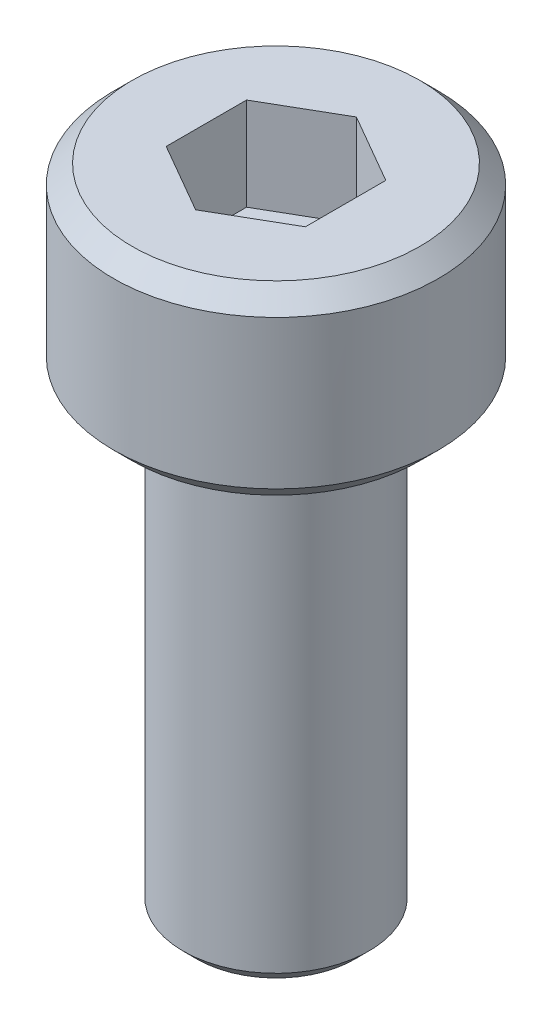
ISO-10303-21;
HEADER;
FILE_DESCRIPTION(('STEP AP214'),'2;1');
FILE_NAME('part.step','',(''),(''),'','','');
FILE_SCHEMA(('AUTOMOTIVE_DESIGN { 1 0 10303 214 1 1 1 1 }'));
ENDSEC;
DATA;
#1=APPLICATION_CONTEXT('core data for automotive mechanical design processes');
#2=APPLICATION_PROTOCOL_DEFINITION('international standard','automotive_design',2000,#1);
#3=PRODUCT_CONTEXT('',#1,'mechanical');
#4=PRODUCT('Part','Part','',(#3));
#5=PRODUCT_RELATED_PRODUCT_CATEGORY('part','',(#4));
#6=PRODUCT_DEFINITION_FORMATION('','',#4);
#7=PRODUCT_DEFINITION_CONTEXT('part definition',#1,'design');
#8=PRODUCT_DEFINITION('design','',#6,#7);
#9=PRODUCT_DEFINITION_SHAPE('','',#8);
#10=(LENGTH_UNIT() NAMED_UNIT(*) SI_UNIT(.MILLI.,.METRE.));
#11=(NAMED_UNIT(*) PLANE_ANGLE_UNIT() SI_UNIT($,.RADIAN.));
#12=(NAMED_UNIT(*) SI_UNIT($,.STERADIAN.) SOLID_ANGLE_UNIT());
#13=UNCERTAINTY_MEASURE_WITH_UNIT(LENGTH_MEASURE(1.E-05),#10,'distance_accuracy_value','');
#14=(GEOMETRIC_REPRESENTATION_CONTEXT(3) GLOBAL_UNCERTAINTY_ASSIGNED_CONTEXT((#13)) GLOBAL_UNIT_ASSIGNED_CONTEXT((#10,
#11,#12)) REPRESENTATION_CONTEXT('',''));
#15=CARTESIAN_POINT('',(0.,0.,0.));
#16=DIRECTION('',(0.,0.,1.));
#17=DIRECTION('',(1.,0.,0.));
#18=AXIS2_PLACEMENT_3D('',#15,#16,#17);
#19=CARTESIAN_POINT('',(0.,2.,-1.73205080756888));
#20=DIRECTION('',(-0.500000000000001,0.,-0.866025403784438));
#21=DIRECTION('',(-0.866025403784438,0.,0.500000000000001));
#22=AXIS2_PLACEMENT_3D('',#19,#20,#21);
#23=PLANE('',#22);
#24=DIRECTION('',(0.,1.,0.));
#25=VECTOR('',#24,1.);
#26=CARTESIAN_POINT('',(-1.5,2.,-0.866025403784438));
#27=LINE('',#26,#25);
#28=CARTESIAN_POINT('',(-1.5,4.,-0.866025403784437));
#29=VERTEX_POINT('',#28);
#30=CARTESIAN_POINT('',(-1.5,2.,-0.866025403784437));
#31=VERTEX_POINT('',#30);
#32=EDGE_CURVE('E81',#29,#31,#27,.F.);
#33=ORIENTED_EDGE('',*,*,#32,.T.);
#34=DIRECTION('',(-0.866025403784438,0.,0.500000000000001));
#35=VECTOR('',#34,1.);
#36=CARTESIAN_POINT('',(0.,2.,-1.73205080756888));
#37=LINE('',#36,#35);
#38=CARTESIAN_POINT('',(0.,2.,-1.73205080756888));
#39=VERTEX_POINT('',#38);
#40=EDGE_CURVE('E70',#39,#31,#37,.T.);
#41=ORIENTED_EDGE('',*,*,#40,.F.);
#42=DIRECTION('',(0.,1.,0.));
#43=VECTOR('',#42,1.);
#44=CARTESIAN_POINT('',(0.,2.,-1.73205080756888));
#45=LINE('',#44,#43);
#46=CARTESIAN_POINT('',(0.,4.,-1.73205080756888));
#47=VERTEX_POINT('',#46);
#48=EDGE_CURVE('E90',#39,#47,#45,.T.);
#49=ORIENTED_EDGE('',*,*,#48,.T.);
#50=DIRECTION('',(-0.866025403784438,0.,0.500000000000001));
#51=VECTOR('',#50,1.);
#52=CARTESIAN_POINT('',(0.,4.,-1.73205080756888));
#53=LINE('',#52,#51);
#54=EDGE_CURVE('E65',#29,#47,#53,.F.);
#55=ORIENTED_EDGE('',*,*,#54,.F.);
#56=EDGE_LOOP('',(#33,#41,#49,#55));
#57=FACE_BOUND('',#56,.T.);
#58=ADVANCED_FACE('F15',(#57),#23,.F.);
#59=CARTESIAN_POINT('',(-1.5,2.,-0.866025403784438));
#60=DIRECTION('',(-1.,0.,0.));
#61=DIRECTION('',(0.,0.,1.));
#62=AXIS2_PLACEMENT_3D('',#59,#60,#61);
#63=PLANE('',#62);
#64=DIRECTION('',(0.,1.,0.));
#65=VECTOR('',#64,1.);
#66=CARTESIAN_POINT('',(-1.5,2.,0.866025403784439));
#67=LINE('',#66,#65);
#68=CARTESIAN_POINT('',(-1.5,4.,0.866025403784439));
#69=VERTEX_POINT('',#68);
#70=CARTESIAN_POINT('',(-1.5,2.,0.866025403784439));
#71=VERTEX_POINT('',#70);
#72=EDGE_CURVE('E86',#69,#71,#67,.F.);
#73=ORIENTED_EDGE('',*,*,#72,.T.);
#74=DIRECTION('',(0.,0.,1.));
#75=VECTOR('',#74,1.);
#76=CARTESIAN_POINT('',(-1.5,2.,-0.866025403784438));
#77=LINE('',#76,#75);
#78=EDGE_CURVE('E74',#31,#71,#77,.T.);
#79=ORIENTED_EDGE('',*,*,#78,.F.);
#80=ORIENTED_EDGE('',*,*,#32,.F.);
#81=DIRECTION('',(0.,0.,1.));
#82=VECTOR('',#81,1.);
#83=CARTESIAN_POINT('',(-1.5,4.,-0.866025403784438));
#84=LINE('',#83,#82);
#85=EDGE_CURVE('E88',#69,#29,#84,.F.);
#86=ORIENTED_EDGE('',*,*,#85,.F.);
#87=EDGE_LOOP('',(#73,#79,#80,#86));
#88=FACE_BOUND('',#87,.T.);
#89=ADVANCED_FACE('F84',(#88),#63,.F.);
#90=CARTESIAN_POINT('',(1.5,2.,-0.866025403784438));
#91=DIRECTION('',(0.5,0.,-0.866025403784439));
#92=DIRECTION('',(-0.866025403784439,0.,-0.5));
#93=AXIS2_PLACEMENT_3D('',#90,#91,#92);
#94=PLANE('',#93);
#95=ORIENTED_EDGE('',*,*,#48,.F.);
#96=DIRECTION('',(-0.866025403784439,0.,-0.5));
#97=VECTOR('',#96,1.);
#98=CARTESIAN_POINT('',(1.5,2.,-0.866025403784438));
#99=LINE('',#98,#97);
#100=CARTESIAN_POINT('',(1.5,2.,-0.866025403784438));
#101=VERTEX_POINT('',#100);
#102=EDGE_CURVE('E77',#101,#39,#99,.T.);
#103=ORIENTED_EDGE('',*,*,#102,.F.);
#104=DIRECTION('',(0.,1.,0.));
#105=VECTOR('',#104,1.);
#106=CARTESIAN_POINT('',(1.5,2.,-0.866025403784438));
#107=LINE('',#106,#105);
#108=CARTESIAN_POINT('',(1.5,4.,-0.866025403784438));
#109=VERTEX_POINT('',#108);
#110=EDGE_CURVE('E120',#101,#109,#107,.T.);
#111=ORIENTED_EDGE('',*,*,#110,.T.);
#112=DIRECTION('',(-0.866025403784439,0.,-0.5));
#113=VECTOR('',#112,1.);
#114=CARTESIAN_POINT('',(1.5,4.,-0.866025403784438));
#115=LINE('',#114,#113);
#116=EDGE_CURVE('E132',#47,#109,#115,.F.);
#117=ORIENTED_EDGE('',*,*,#116,.F.);
#118=EDGE_LOOP('',(#95,#103,#111,#117));
#119=FACE_BOUND('',#118,.T.);
#120=ADVANCED_FACE('F135',(#119),#94,.F.);
#121=CARTESIAN_POINT('',(-1.5,2.,0.866025403784439));
#122=DIRECTION('',(-0.499999999999999,0.,0.866025403784439));
#123=DIRECTION('',(0.866025403784439,0.,0.499999999999999));
#124=AXIS2_PLACEMENT_3D('',#121,#122,#123);
#125=PLANE('',#124);
#126=DIRECTION('',(0.,1.,0.));
#127=VECTOR('',#126,1.);
#128=CARTESIAN_POINT('',(0.,2.,1.73205080756888));
#129=LINE('',#128,#127);
#130=CARTESIAN_POINT('',(0.,4.,1.73205080756888));
#131=VERTEX_POINT('',#130);
#132=CARTESIAN_POINT('',(0.,2.,1.73205080756888));
#133=VERTEX_POINT('',#132);
#134=EDGE_CURVE('E117',#131,#133,#129,.F.);
#135=ORIENTED_EDGE('',*,*,#134,.T.);
#136=DIRECTION('',(0.866025403784439,0.,0.499999999999999));
#137=VECTOR('',#136,1.);
#138=CARTESIAN_POINT('',(-1.5,2.,0.866025403784439));
#139=LINE('',#138,#137);
#140=EDGE_CURVE('E126',#71,#133,#139,.T.);
#141=ORIENTED_EDGE('',*,*,#140,.F.);
#142=ORIENTED_EDGE('',*,*,#72,.F.);
#143=DIRECTION('',(0.866025403784439,0.,0.499999999999999));
#144=VECTOR('',#143,1.);
#145=CARTESIAN_POINT('',(-1.5,4.,0.866025403784439));
#146=LINE('',#145,#144);
#147=EDGE_CURVE('E128',#131,#69,#146,.F.);
#148=ORIENTED_EDGE('',*,*,#147,.F.);
#149=EDGE_LOOP('',(#135,#141,#142,#148));
#150=FACE_BOUND('',#149,.T.);
#151=ADVANCED_FACE('F142',(#150),#125,.F.);
#152=CARTESIAN_POINT('',(1.5,2.,2.59807621135331));
#153=DIRECTION('',(0.,1.,0.));
#154=DIRECTION('',(0.,0.,1.));
#155=AXIS2_PLACEMENT_3D('',#152,#153,#154);
#156=PLANE('',#155);
#157=ORIENTED_EDGE('',*,*,#40,.T.);
#158=ORIENTED_EDGE('',*,*,#78,.T.);
#159=ORIENTED_EDGE('',*,*,#140,.T.);
#160=DIRECTION('',(0.866025403784438,0.,-0.5));
#161=VECTOR('',#160,1.);
#162=CARTESIAN_POINT('',(0.,2.,1.73205080756888));
#163=LINE('',#162,#161);
#164=CARTESIAN_POINT('',(1.5,2.,0.866025403784438));
#165=VERTEX_POINT('',#164);
#166=EDGE_CURVE('E115',#133,#165,#163,.T.);
#167=ORIENTED_EDGE('',*,*,#166,.T.);
#168=DIRECTION('',(0.,0.,-1.));
#169=VECTOR('',#168,1.);
#170=CARTESIAN_POINT('',(1.5,2.,0.866025403784438));
#171=LINE('',#170,#169);
#172=EDGE_CURVE('E123',#165,#101,#171,.T.);
#173=ORIENTED_EDGE('',*,*,#172,.T.);
#174=ORIENTED_EDGE('',*,*,#102,.T.);
#175=EDGE_LOOP('',(#157,#158,#159,#167,#173,#174));
#176=FACE_BOUND('',#175,.T.);
#177=ADVANCED_FACE('F71',(#176),#156,.T.);
#178=CARTESIAN_POINT('',(1.5,2.,0.866025403784438));
#179=DIRECTION('',(1.,0.,0.));
#180=DIRECTION('',(0.,0.,-1.));
#181=AXIS2_PLACEMENT_3D('',#178,#179,#180);
#182=PLANE('',#181);
#183=ORIENTED_EDGE('',*,*,#110,.F.);
#184=ORIENTED_EDGE('',*,*,#172,.F.);
#185=DIRECTION('',(0.,1.,0.));
#186=VECTOR('',#185,1.);
#187=CARTESIAN_POINT('',(1.5,2.,0.866025403784437));
#188=LINE('',#187,#186);
#189=CARTESIAN_POINT('',(1.5,4.,0.866025403784438));
#190=VERTEX_POINT('',#189);
#191=EDGE_CURVE('E113',#165,#190,#188,.T.);
#192=ORIENTED_EDGE('',*,*,#191,.T.);
#193=DIRECTION('',(0.,0.,-1.));
#194=VECTOR('',#193,1.);
#195=CARTESIAN_POINT('',(1.5,4.,0.866025403784438));
#196=LINE('',#195,#194);
#197=EDGE_CURVE('E33',#109,#190,#196,.F.);
#198=ORIENTED_EDGE('',*,*,#197,.F.);
#199=EDGE_LOOP('',(#183,#184,#192,#198));
#200=FACE_BOUND('',#199,.T.);
#201=ADVANCED_FACE('F149',(#200),#182,.F.);
#202=CARTESIAN_POINT('',(0.,2.,1.73205080756888));
#203=DIRECTION('',(0.5,0.,0.866025403784438));
#204=DIRECTION('',(0.866025403784438,0.,-0.5));
#205=AXIS2_PLACEMENT_3D('',#202,#203,#204);
#206=PLANE('',#205);
#207=ORIENTED_EDGE('',*,*,#191,.F.);
#208=ORIENTED_EDGE('',*,*,#166,.F.);
#209=ORIENTED_EDGE('',*,*,#134,.F.);
#210=DIRECTION('',(-0.866025403784438,0.,0.5));
#211=VECTOR('',#210,1.);
#212=CARTESIAN_POINT('',(1.5,4.,0.866025403784438));
#213=LINE('',#212,#211);
#214=EDGE_CURVE('E111',#190,#131,#213,.T.);
#215=ORIENTED_EDGE('',*,*,#214,.F.);
#216=EDGE_LOOP('',(#207,#208,#209,#215));
#217=FACE_BOUND('',#216,.T.);
#218=ADVANCED_FACE('F147',(#217),#206,.F.);
#219=CARTESIAN_POINT('',(0.,4.,0.));
#220=DIRECTION('',(0.,1.,0.));
#221=DIRECTION('',(0.,0.,1.));
#222=AXIS2_PLACEMENT_3D('',#219,#220,#221);
#223=PLANE('',#222);
#224=ORIENTED_EDGE('',*,*,#197,.T.);
#225=ORIENTED_EDGE('',*,*,#214,.T.);
#226=ORIENTED_EDGE('',*,*,#147,.T.);
#227=ORIENTED_EDGE('',*,*,#85,.T.);
#228=ORIENTED_EDGE('',*,*,#54,.T.);
#229=ORIENTED_EDGE('',*,*,#116,.T.);
#230=EDGE_LOOP('',(#224,#225,#226,#227,#228,#229));
#231=FACE_BOUND('',#230,.T.);
#232=CARTESIAN_POINT('',(0.,4.0000000000191,0.));
#233=DIRECTION('',(0.,-1.,0.));
#234=DIRECTION('',(0.,0.,-1.));
#235=AXIS2_PLACEMENT_3D('',#232,#233,#234);
#236=CIRCLE('',#235,3.10000000001764);
#237=CARTESIAN_POINT('',(0.,4.0000000000191,-3.10000000001764));
#238=VERTEX_POINT('',#237);
#239=EDGE_CURVE('E18',#238,#238,#236,.T.);
#240=ORIENTED_EDGE('',*,*,#239,.F.);
#241=EDGE_LOOP('',(#240));
#242=FACE_BOUND('',#241,.T.);
#243=ADVANCED_FACE('F137',(#231,#242),#223,.T.);
#244=CARTESIAN_POINT('',(0.,3.60000000000582,0.));
#245=DIRECTION('',(0.,-1.,0.));
#246=DIRECTION('',(0.,0.,-1.));
#247=AXIS2_PLACEMENT_3D('',#244,#245,#246);
#248=CONICAL_SURFACE('',#247,3.50000000003092,0.785398163397448);
#249=ORIENTED_EDGE('',*,*,#239,.T.);
#250=EDGE_LOOP('',(#249));
#251=FACE_BOUND('',#250,.T.);
#252=CARTESIAN_POINT('',(0.,3.6,0.));
#253=DIRECTION('',(0.,-1.,0.));
#254=DIRECTION('',(0.,0.,-1.));
#255=AXIS2_PLACEMENT_3D('',#252,#253,#254);
#256=CIRCLE('',#255,3.5);
#257=CARTESIAN_POINT('',(0.,3.6,-3.5));
#258=VERTEX_POINT('',#257);
#259=EDGE_CURVE('E103',#258,#258,#256,.T.);
#260=ORIENTED_EDGE('',*,*,#259,.F.);
#261=EDGE_LOOP('',(#260));
#262=FACE_BOUND('',#261,.T.);
#263=ADVANCED_FACE('F186',(#251,#262),#248,.T.);
#264=CARTESIAN_POINT('',(0.,4.,0.));
#265=DIRECTION('',(0.,-1.,0.));
#266=DIRECTION('',(0.,0.,-1.));
#267=AXIS2_PLACEMENT_3D('',#264,#265,#266);
#268=CYLINDRICAL_SURFACE('',#267,3.5);
#269=ORIENTED_EDGE('',*,*,#259,.T.);
#270=EDGE_LOOP('',(#269));
#271=FACE_BOUND('',#270,.T.);
#272=CARTESIAN_POINT('',(0.,0.400000000013279,0.));
#273=DIRECTION('',(0.,1.,0.));
#274=DIRECTION('',(0.,0.,1.));
#275=AXIS2_PLACEMENT_3D('',#272,#273,#274);
#276=CIRCLE('',#275,3.50000000003092);
#277=CARTESIAN_POINT('',(0.,0.400000000013279,3.50000000003092));
#278=VERTEX_POINT('',#277);
#279=EDGE_CURVE('E99',#278,#278,#276,.F.);
#280=ORIENTED_EDGE('',*,*,#279,.F.);
#281=EDGE_LOOP('',(#280));
#282=FACE_BOUND('',#281,.T.);
#283=ADVANCED_FACE('F182',(#271,#282),#268,.T.);
#284=CARTESIAN_POINT('',(0.,-10.,0.));
#285=DIRECTION('',(0.,1.,0.));
#286=DIRECTION('',(0.,0.,1.));
#287=AXIS2_PLACEMENT_3D('',#284,#285,#286);
#288=PLANE('',#287);
#289=CARTESIAN_POINT('',(0.,-9.99999999999091,0.));
#290=DIRECTION('',(0.,1.,0.));
#291=DIRECTION('',(0.,0.,1.));
#292=AXIS2_PLACEMENT_3D('',#289,#290,#291);
#293=CIRCLE('',#292,1.70000000008486);
#294=CARTESIAN_POINT('',(0.,-9.99999999999091,1.70000000008486));
#295=VERTEX_POINT('',#294);
#296=EDGE_CURVE('E97',#295,#295,#293,.T.);
#297=ORIENTED_EDGE('',*,*,#296,.F.);
#298=EDGE_LOOP('',(#297));
#299=FACE_BOUND('',#298,.T.);
#300=ADVANCED_FACE('F178',(#299),#288,.F.);
#301=CARTESIAN_POINT('',(0.,0.399999999956435,0.));
#302=DIRECTION('',(0.,1.,0.));
#303=DIRECTION('',(0.,0.,1.));
#304=AXIS2_PLACEMENT_3D('',#301,#302,#303);
#305=CONICAL_SURFACE('',#304,3.49999999991724,0.785398163326394);
#306=CARTESIAN_POINT('',(0.,5.6843418860808E-11,0.));
#307=DIRECTION('',(0.,1.,0.));
#308=DIRECTION('',(0.,0.,1.));
#309=AXIS2_PLACEMENT_3D('',#306,#307,#308);
#310=CIRCLE('',#309,3.10000000007449);
#311=CARTESIAN_POINT('',(0.,5.6843418860808E-11,3.10000000007449));
#312=VERTEX_POINT('',#311);
#313=EDGE_CURVE('E95',#312,#312,#310,.T.);
#314=ORIENTED_EDGE('',*,*,#313,.T.);
#315=EDGE_LOOP('',(#314));
#316=FACE_BOUND('',#315,.T.);
#317=ORIENTED_EDGE('',*,*,#279,.T.);
#318=EDGE_LOOP('',(#317));
#319=FACE_BOUND('',#318,.T.);
#320=ADVANCED_FACE('F174',(#316,#319),#305,.T.);
#321=CARTESIAN_POINT('',(0.,-9.70000000012305,0.));
#322=DIRECTION('',(0.,1.,0.));
#323=DIRECTION('',(0.,0.,1.));
#324=AXIS2_PLACEMENT_3D('',#321,#322,#323);
#325=CONICAL_SURFACE('',#324,1.99999999995271,0.785398163397448);
#326=CARTESIAN_POINT('',(0.,-9.7,0.));
#327=DIRECTION('',(0.,1.,0.));
#328=DIRECTION('',(0.,0.,1.));
#329=AXIS2_PLACEMENT_3D('',#326,#327,#328);
#330=CIRCLE('',#329,2.);
#331=CARTESIAN_POINT('',(0.,-9.7,2.));
#332=VERTEX_POINT('',#331);
#333=EDGE_CURVE('E24',#332,#332,#330,.T.);
#334=ORIENTED_EDGE('',*,*,#333,.F.);
#335=EDGE_LOOP('',(#334));
#336=FACE_BOUND('',#335,.T.);
#337=ORIENTED_EDGE('',*,*,#296,.T.);
#338=EDGE_LOOP('',(#337));
#339=FACE_BOUND('',#338,.T.);
#340=ADVANCED_FACE('F167',(#336,#339),#325,.T.);
#341=CARTESIAN_POINT('',(0.,0.,0.));
#342=DIRECTION('',(0.,1.,0.));
#343=DIRECTION('',(0.,0.,1.));
#344=AXIS2_PLACEMENT_3D('',#341,#342,#343);
#345=PLANE('',#344);
#346=CARTESIAN_POINT('',(0.,0.,0.));
#347=DIRECTION('',(0.,1.,0.));
#348=DIRECTION('',(0.,0.,1.));
#349=AXIS2_PLACEMENT_3D('',#346,#347,#348);
#350=CIRCLE('',#349,2.);
#351=CARTESIAN_POINT('',(0.,0.,2.));
#352=VERTEX_POINT('',#351);
#353=EDGE_CURVE('E10',#352,#352,#350,.F.);
#354=ORIENTED_EDGE('',*,*,#353,.F.);
#355=EDGE_LOOP('',(#354));
#356=FACE_BOUND('',#355,.T.);
#357=ORIENTED_EDGE('',*,*,#313,.F.);
#358=EDGE_LOOP('',(#357));
#359=FACE_BOUND('',#358,.T.);
#360=ADVANCED_FACE('F161',(#356,#359),#345,.F.);
#361=CARTESIAN_POINT('',(0.,-10.,0.));
#362=DIRECTION('',(0.,1.,0.));
#363=DIRECTION('',(0.,0.,1.));
#364=AXIS2_PLACEMENT_3D('',#361,#362,#363);
#365=CYLINDRICAL_SURFACE('',#364,2.);
#366=ORIENTED_EDGE('',*,*,#353,.T.);
#367=EDGE_LOOP('',(#366));
#368=FACE_BOUND('',#367,.T.);
#369=ORIENTED_EDGE('',*,*,#333,.T.);
#370=EDGE_LOOP('',(#369));
#371=FACE_BOUND('',#370,.T.);
#372=ADVANCED_FACE('F159',(#368,#371),#365,.T.);
#373=CLOSED_SHELL('',(#58,#89,#120,#151,#177,#201,#218,#243,#263,#283,#300,#320,#340,#360,#372));
#374=MANIFOLD_SOLID_BREP('B1',#373);
#375=ADVANCED_BREP_SHAPE_REPRESENTATION('',(#18,#374),#14);
#376=SHAPE_DEFINITION_REPRESENTATION(#9,#375);
ENDSEC;
END-ISO-10303-21;
